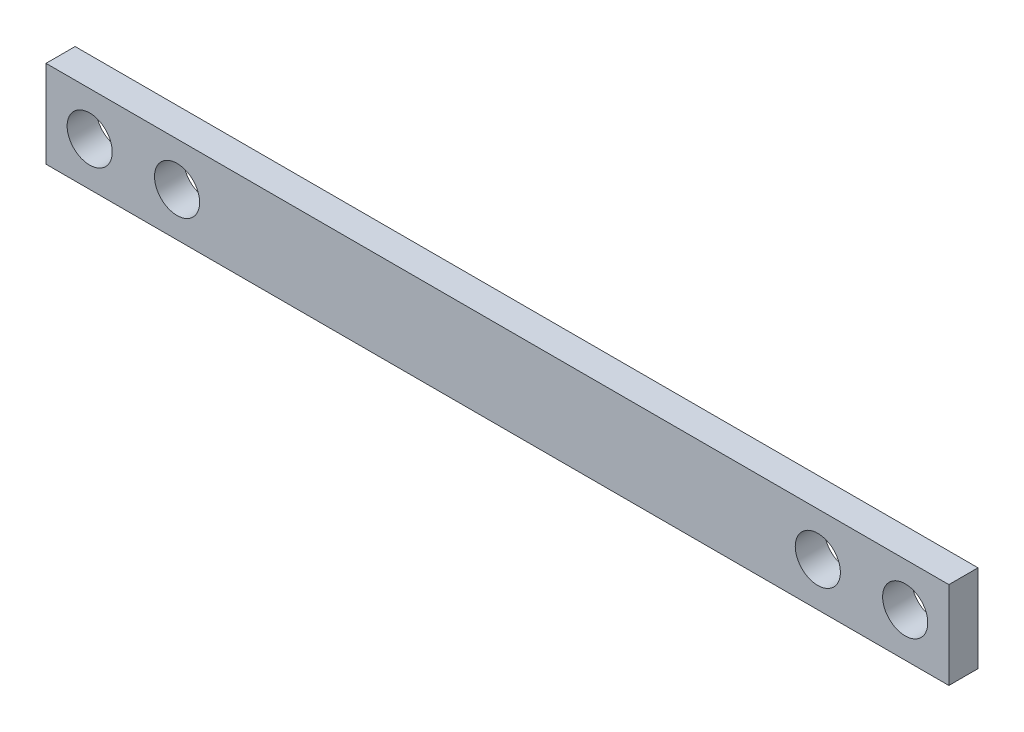
ISO-10303-21;
HEADER;
FILE_DESCRIPTION(('STEP AP214'),'2;1');
FILE_NAME('part.step','',(''),(''),'','','');
FILE_SCHEMA(('AUTOMOTIVE_DESIGN { 1 0 10303 214 1 1 1 1 }'));
ENDSEC;
DATA;
#1=APPLICATION_CONTEXT('core data for automotive mechanical design processes');
#2=APPLICATION_PROTOCOL_DEFINITION('international standard','automotive_design',2000,#1);
#3=PRODUCT_CONTEXT('',#1,'mechanical');
#4=PRODUCT('Part','Part','',(#3));
#5=PRODUCT_RELATED_PRODUCT_CATEGORY('part','',(#4));
#6=PRODUCT_DEFINITION_FORMATION('','',#4);
#7=PRODUCT_DEFINITION_CONTEXT('part definition',#1,'design');
#8=PRODUCT_DEFINITION('design','',#6,#7);
#9=PRODUCT_DEFINITION_SHAPE('','',#8);
#10=(LENGTH_UNIT() NAMED_UNIT(*) SI_UNIT(.MILLI.,.METRE.));
#11=(NAMED_UNIT(*) PLANE_ANGLE_UNIT() SI_UNIT($,.RADIAN.));
#12=(NAMED_UNIT(*) SI_UNIT($,.STERADIAN.) SOLID_ANGLE_UNIT());
#13=UNCERTAINTY_MEASURE_WITH_UNIT(LENGTH_MEASURE(1.E-05),#10,'distance_accuracy_value','');
#14=(GEOMETRIC_REPRESENTATION_CONTEXT(3) GLOBAL_UNCERTAINTY_ASSIGNED_CONTEXT((#13)) GLOBAL_UNIT_ASSIGNED_CONTEXT((#10,
#11,#12)) REPRESENTATION_CONTEXT('',''));
#15=CARTESIAN_POINT('',(0.,0.,0.));
#16=DIRECTION('',(0.,0.,1.));
#17=DIRECTION('',(1.,0.,0.));
#18=AXIS2_PLACEMENT_3D('',#15,#16,#17);
#19=CARTESIAN_POINT('',(31.,3.,2.));
#20=DIRECTION('',(-1.,0.,0.));
#21=DIRECTION('',(0.,0.,1.));
#22=AXIS2_PLACEMENT_3D('',#19,#20,#21);
#23=PLANE('',#22);
#24=DIRECTION('',(0.,1.,0.));
#25=VECTOR('',#24,1.);
#26=CARTESIAN_POINT('',(31.,3.,0.));
#27=LINE('',#26,#25);
#28=CARTESIAN_POINT('',(31.,-3.,0.));
#29=VERTEX_POINT('',#28);
#30=CARTESIAN_POINT('',(31.,3.,0.));
#31=VERTEX_POINT('',#30);
#32=EDGE_CURVE('E99',#29,#31,#27,.T.);
#33=ORIENTED_EDGE('',*,*,#32,.T.);
#34=DIRECTION('',(0.,0.,-1.));
#35=VECTOR('',#34,1.);
#36=CARTESIAN_POINT('',(31.,3.,2.));
#37=LINE('',#36,#35);
#38=CARTESIAN_POINT('',(31.,3.,2.));
#39=VERTEX_POINT('',#38);
#40=EDGE_CURVE('E11',#39,#31,#37,.T.);
#41=ORIENTED_EDGE('',*,*,#40,.F.);
#42=DIRECTION('',(0.,1.,0.));
#43=VECTOR('',#42,1.);
#44=CARTESIAN_POINT('',(31.,3.,2.));
#45=LINE('',#44,#43);
#46=CARTESIAN_POINT('',(31.,-3.,2.));
#47=VERTEX_POINT('',#46);
#48=EDGE_CURVE('E87',#47,#39,#45,.T.);
#49=ORIENTED_EDGE('',*,*,#48,.F.);
#50=DIRECTION('',(0.,0.,-1.));
#51=VECTOR('',#50,1.);
#52=CARTESIAN_POINT('',(31.,-3.,2.));
#53=LINE('',#52,#51);
#54=EDGE_CURVE('E95',#47,#29,#53,.T.);
#55=ORIENTED_EDGE('',*,*,#54,.T.);
#56=EDGE_LOOP('',(#33,#41,#49,#55));
#57=FACE_BOUND('',#56,.T.);
#58=ADVANCED_FACE('F36',(#57),#23,.F.);
#59=CARTESIAN_POINT('',(-31.,3.,2.));
#60=DIRECTION('',(0.,-1.,0.));
#61=DIRECTION('',(0.,0.,-1.));
#62=AXIS2_PLACEMENT_3D('',#59,#60,#61);
#63=PLANE('',#62);
#64=DIRECTION('',(-1.,0.,0.));
#65=VECTOR('',#64,1.);
#66=CARTESIAN_POINT('',(-31.,3.,0.));
#67=LINE('',#66,#65);
#68=CARTESIAN_POINT('',(-31.,3.,0.));
#69=VERTEX_POINT('',#68);
#70=EDGE_CURVE('E91',#31,#69,#67,.T.);
#71=ORIENTED_EDGE('',*,*,#70,.T.);
#72=DIRECTION('',(0.,0.,-1.));
#73=VECTOR('',#72,1.);
#74=CARTESIAN_POINT('',(-31.,3.,2.));
#75=LINE('',#74,#73);
#76=CARTESIAN_POINT('',(-31.,3.,2.));
#77=VERTEX_POINT('',#76);
#78=EDGE_CURVE('E44',#77,#69,#75,.T.);
#79=ORIENTED_EDGE('',*,*,#78,.F.);
#80=DIRECTION('',(-1.,0.,0.));
#81=VECTOR('',#80,1.);
#82=CARTESIAN_POINT('',(-31.,3.,2.));
#83=LINE('',#82,#81);
#84=EDGE_CURVE('E82',#39,#77,#83,.T.);
#85=ORIENTED_EDGE('',*,*,#84,.F.);
#86=ORIENTED_EDGE('',*,*,#40,.T.);
#87=EDGE_LOOP('',(#71,#79,#85,#86));
#88=FACE_BOUND('',#87,.T.);
#89=ADVANCED_FACE('F90',(#88),#63,.F.);
#90=CARTESIAN_POINT('',(-31.,3.,2.));
#91=DIRECTION('',(1.,0.,0.));
#92=DIRECTION('',(0.,0.,-1.));
#93=AXIS2_PLACEMENT_3D('',#90,#91,#92);
#94=PLANE('',#93);
#95=DIRECTION('',(0.,-1.,0.));
#96=VECTOR('',#95,1.);
#97=CARTESIAN_POINT('',(-31.,3.,0.));
#98=LINE('',#97,#96);
#99=CARTESIAN_POINT('',(-31.,-3.,0.));
#100=VERTEX_POINT('',#99);
#101=EDGE_CURVE('E69',#69,#100,#98,.T.);
#102=ORIENTED_EDGE('',*,*,#101,.T.);
#103=DIRECTION('',(0.,0.,-1.));
#104=VECTOR('',#103,1.);
#105=CARTESIAN_POINT('',(-31.,-3.,2.));
#106=LINE('',#105,#104);
#107=CARTESIAN_POINT('',(-31.,-3.,2.));
#108=VERTEX_POINT('',#107);
#109=EDGE_CURVE('E92',#108,#100,#106,.T.);
#110=ORIENTED_EDGE('',*,*,#109,.F.);
#111=DIRECTION('',(0.,-1.,0.));
#112=VECTOR('',#111,1.);
#113=CARTESIAN_POINT('',(-31.,3.,2.));
#114=LINE('',#113,#112);
#115=EDGE_CURVE('E85',#77,#108,#114,.T.);
#116=ORIENTED_EDGE('',*,*,#115,.F.);
#117=ORIENTED_EDGE('',*,*,#78,.T.);
#118=EDGE_LOOP('',(#102,#110,#116,#117));
#119=FACE_BOUND('',#118,.T.);
#120=ADVANCED_FACE('F93',(#119),#94,.F.);
#121=CARTESIAN_POINT('',(-31.,-3.,2.));
#122=DIRECTION('',(0.,1.,0.));
#123=DIRECTION('',(0.,0.,1.));
#124=AXIS2_PLACEMENT_3D('',#121,#122,#123);
#125=PLANE('',#124);
#126=DIRECTION('',(1.,0.,0.));
#127=VECTOR('',#126,1.);
#128=CARTESIAN_POINT('',(-31.,-3.,0.));
#129=LINE('',#128,#127);
#130=EDGE_CURVE('E75',#100,#29,#129,.T.);
#131=ORIENTED_EDGE('',*,*,#130,.T.);
#132=ORIENTED_EDGE('',*,*,#54,.F.);
#133=DIRECTION('',(1.,0.,0.));
#134=VECTOR('',#133,1.);
#135=CARTESIAN_POINT('',(-31.,-3.,2.));
#136=LINE('',#135,#134);
#137=EDGE_CURVE('E52',#108,#47,#136,.T.);
#138=ORIENTED_EDGE('',*,*,#137,.F.);
#139=ORIENTED_EDGE('',*,*,#109,.T.);
#140=EDGE_LOOP('',(#131,#132,#138,#139));
#141=FACE_BOUND('',#140,.T.);
#142=ADVANCED_FACE('F107',(#141),#125,.F.);
#143=CARTESIAN_POINT('',(0.,0.,2.));
#144=DIRECTION('',(0.,0.,1.));
#145=DIRECTION('',(1.,0.,0.));
#146=AXIS2_PLACEMENT_3D('',#143,#144,#145);
#147=PLANE('',#146);
#148=CARTESIAN_POINT('',(28.,0.,2.));
#149=DIRECTION('',(0.,0.,1.));
#150=DIRECTION('',(-1.,0.,0.));
#151=AXIS2_PLACEMENT_3D('',#148,#149,#150);
#152=CIRCLE('',#151,1.55);
#153=CARTESIAN_POINT('',(26.45,0.,2.));
#154=VERTEX_POINT('',#153);
#155=EDGE_CURVE('E131',#154,#154,#152,.T.);
#156=ORIENTED_EDGE('',*,*,#155,.F.);
#157=EDGE_LOOP('',(#156));
#158=FACE_BOUND('',#157,.T.);
#159=CARTESIAN_POINT('',(22.,0.,2.));
#160=DIRECTION('',(0.,0.,1.));
#161=DIRECTION('',(-1.,0.,0.));
#162=AXIS2_PLACEMENT_3D('',#159,#160,#161);
#163=CIRCLE('',#162,1.55);
#164=CARTESIAN_POINT('',(20.45,0.,2.));
#165=VERTEX_POINT('',#164);
#166=EDGE_CURVE('E125',#165,#165,#163,.T.);
#167=ORIENTED_EDGE('',*,*,#166,.F.);
#168=EDGE_LOOP('',(#167));
#169=FACE_BOUND('',#168,.T.);
#170=CARTESIAN_POINT('',(-22.,0.,2.));
#171=DIRECTION('',(0.,0.,1.));
#172=DIRECTION('',(1.,0.,0.));
#173=AXIS2_PLACEMENT_3D('',#170,#171,#172);
#174=CIRCLE('',#173,1.55);
#175=CARTESIAN_POINT('',(-20.45,0.,2.));
#176=VERTEX_POINT('',#175);
#177=EDGE_CURVE('E119',#176,#176,#174,.T.);
#178=ORIENTED_EDGE('',*,*,#177,.F.);
#179=EDGE_LOOP('',(#178));
#180=FACE_BOUND('',#179,.T.);
#181=CARTESIAN_POINT('',(-28.,0.,2.));
#182=DIRECTION('',(0.,0.,1.));
#183=DIRECTION('',(1.,0.,0.));
#184=AXIS2_PLACEMENT_3D('',#181,#182,#183);
#185=CIRCLE('',#184,1.55);
#186=CARTESIAN_POINT('',(-26.45,0.,2.));
#187=VERTEX_POINT('',#186);
#188=EDGE_CURVE('E113',#187,#187,#185,.T.);
#189=ORIENTED_EDGE('',*,*,#188,.F.);
#190=EDGE_LOOP('',(#189));
#191=FACE_BOUND('',#190,.T.);
#192=ORIENTED_EDGE('',*,*,#48,.T.);
#193=ORIENTED_EDGE('',*,*,#84,.T.);
#194=ORIENTED_EDGE('',*,*,#115,.T.);
#195=ORIENTED_EDGE('',*,*,#137,.T.);
#196=EDGE_LOOP('',(#192,#193,#194,#195));
#197=FACE_BOUND('',#196,.T.);
#198=ADVANCED_FACE('F83',(#158,#169,#180,#191,#197),#147,.T.);
#199=CARTESIAN_POINT('',(0.,0.,0.));
#200=DIRECTION('',(0.,0.,1.));
#201=DIRECTION('',(1.,0.,0.));
#202=AXIS2_PLACEMENT_3D('',#199,#200,#201);
#203=PLANE('',#202);
#204=CARTESIAN_POINT('',(28.,0.,0.));
#205=DIRECTION('',(0.,0.,1.));
#206=DIRECTION('',(-1.,0.,0.));
#207=AXIS2_PLACEMENT_3D('',#204,#205,#206);
#208=CIRCLE('',#207,1.55);
#209=CARTESIAN_POINT('',(26.45,0.,0.));
#210=VERTEX_POINT('',#209);
#211=EDGE_CURVE('E128',#210,#210,#208,.T.);
#212=ORIENTED_EDGE('',*,*,#211,.T.);
#213=EDGE_LOOP('',(#212));
#214=FACE_BOUND('',#213,.T.);
#215=CARTESIAN_POINT('',(22.,0.,0.));
#216=DIRECTION('',(0.,0.,1.));
#217=DIRECTION('',(-1.,0.,0.));
#218=AXIS2_PLACEMENT_3D('',#215,#216,#217);
#219=CIRCLE('',#218,1.55);
#220=CARTESIAN_POINT('',(20.45,0.,0.));
#221=VERTEX_POINT('',#220);
#222=EDGE_CURVE('E122',#221,#221,#219,.T.);
#223=ORIENTED_EDGE('',*,*,#222,.T.);
#224=EDGE_LOOP('',(#223));
#225=FACE_BOUND('',#224,.T.);
#226=CARTESIAN_POINT('',(-22.,0.,0.));
#227=DIRECTION('',(0.,0.,1.));
#228=DIRECTION('',(1.,0.,0.));
#229=AXIS2_PLACEMENT_3D('',#226,#227,#228);
#230=CIRCLE('',#229,1.55);
#231=CARTESIAN_POINT('',(-20.45,0.,0.));
#232=VERTEX_POINT('',#231);
#233=EDGE_CURVE('E116',#232,#232,#230,.T.);
#234=ORIENTED_EDGE('',*,*,#233,.T.);
#235=EDGE_LOOP('',(#234));
#236=FACE_BOUND('',#235,.T.);
#237=CARTESIAN_POINT('',(-28.,0.,0.));
#238=DIRECTION('',(0.,0.,1.));
#239=DIRECTION('',(1.,0.,0.));
#240=AXIS2_PLACEMENT_3D('',#237,#238,#239);
#241=CIRCLE('',#240,1.55);
#242=CARTESIAN_POINT('',(-26.45,0.,0.));
#243=VERTEX_POINT('',#242);
#244=EDGE_CURVE('E102',#243,#243,#241,.T.);
#245=ORIENTED_EDGE('',*,*,#244,.T.);
#246=EDGE_LOOP('',(#245));
#247=FACE_BOUND('',#246,.T.);
#248=ORIENTED_EDGE('',*,*,#32,.F.);
#249=ORIENTED_EDGE('',*,*,#130,.F.);
#250=ORIENTED_EDGE('',*,*,#101,.F.);
#251=ORIENTED_EDGE('',*,*,#70,.F.);
#252=EDGE_LOOP('',(#248,#249,#250,#251));
#253=FACE_BOUND('',#252,.T.);
#254=ADVANCED_FACE('F110',(#214,#225,#236,#247,#253),#203,.F.);
#255=CARTESIAN_POINT('',(-28.,0.,0.));
#256=DIRECTION('',(0.,0.,1.));
#257=DIRECTION('',(1.,0.,0.));
#258=AXIS2_PLACEMENT_3D('',#255,#256,#257);
#259=CYLINDRICAL_SURFACE('',#258,1.55);
#260=ORIENTED_EDGE('',*,*,#244,.F.);
#261=EDGE_LOOP('',(#260));
#262=FACE_BOUND('',#261,.T.);
#263=ORIENTED_EDGE('',*,*,#188,.T.);
#264=EDGE_LOOP('',(#263));
#265=FACE_BOUND('',#264,.T.);
#266=ADVANCED_FACE('F155',(#262,#265),#259,.F.);
#267=CARTESIAN_POINT('',(-22.,0.,0.));
#268=DIRECTION('',(0.,0.,1.));
#269=DIRECTION('',(1.,0.,0.));
#270=AXIS2_PLACEMENT_3D('',#267,#268,#269);
#271=CYLINDRICAL_SURFACE('',#270,1.55);
#272=ORIENTED_EDGE('',*,*,#233,.F.);
#273=EDGE_LOOP('',(#272));
#274=FACE_BOUND('',#273,.T.);
#275=ORIENTED_EDGE('',*,*,#177,.T.);
#276=EDGE_LOOP('',(#275));
#277=FACE_BOUND('',#276,.T.);
#278=ADVANCED_FACE('F157',(#274,#277),#271,.F.);
#279=CARTESIAN_POINT('',(22.,0.,0.));
#280=DIRECTION('',(0.,0.,1.));
#281=DIRECTION('',(1.,0.,0.));
#282=AXIS2_PLACEMENT_3D('',#279,#280,#281);
#283=CYLINDRICAL_SURFACE('',#282,1.55);
#284=ORIENTED_EDGE('',*,*,#222,.F.);
#285=EDGE_LOOP('',(#284));
#286=FACE_BOUND('',#285,.T.);
#287=ORIENTED_EDGE('',*,*,#166,.T.);
#288=EDGE_LOOP('',(#287));
#289=FACE_BOUND('',#288,.T.);
#290=ADVANCED_FACE('F142',(#286,#289),#283,.F.);
#291=CARTESIAN_POINT('',(28.,0.,0.));
#292=DIRECTION('',(0.,0.,1.));
#293=DIRECTION('',(1.,0.,0.));
#294=AXIS2_PLACEMENT_3D('',#291,#292,#293);
#295=CYLINDRICAL_SURFACE('',#294,1.55);
#296=ORIENTED_EDGE('',*,*,#211,.F.);
#297=EDGE_LOOP('',(#296));
#298=FACE_BOUND('',#297,.T.);
#299=ORIENTED_EDGE('',*,*,#155,.T.);
#300=EDGE_LOOP('',(#299));
#301=FACE_BOUND('',#300,.T.);
#302=ADVANCED_FACE('F139',(#298,#301),#295,.F.);
#303=CLOSED_SHELL('',(#58,#89,#120,#142,#198,#254,#266,#278,#290,#302));
#304=MANIFOLD_SOLID_BREP('B2',#303);
#305=ADVANCED_BREP_SHAPE_REPRESENTATION('',(#18,#304),#14);
#306=SHAPE_DEFINITION_REPRESENTATION(#9,#305);
ENDSEC;
END-ISO-10303-21;
